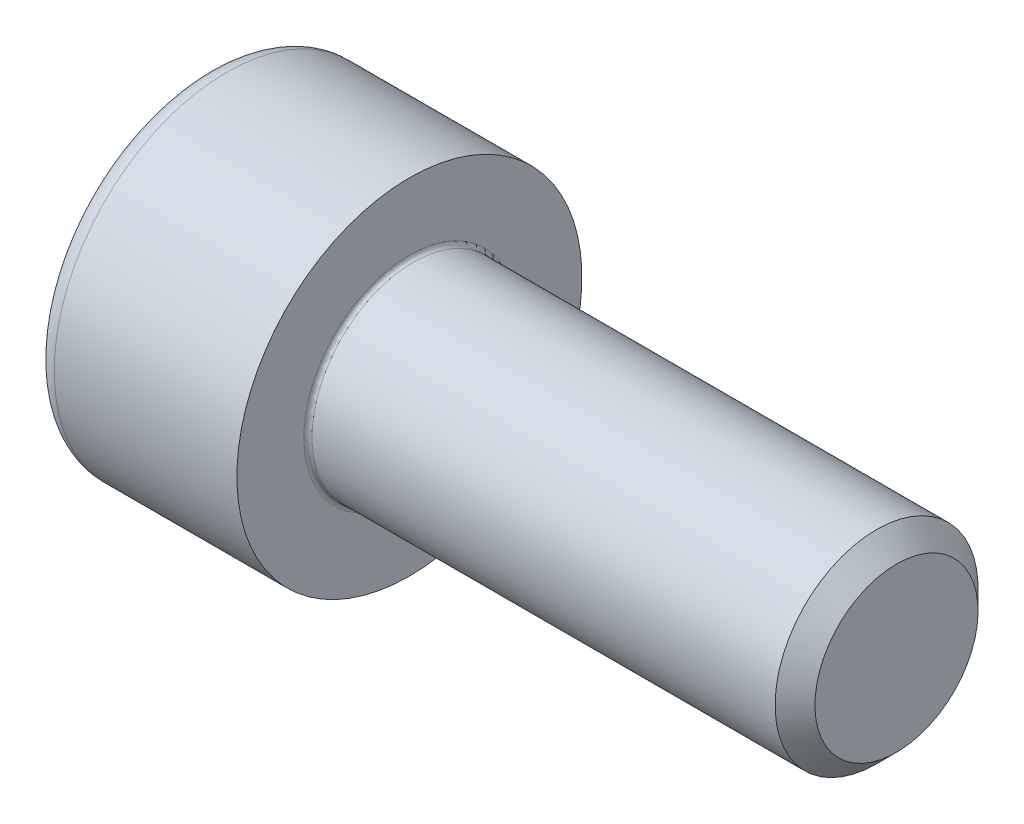
ISO-10303-21;
HEADER;
FILE_DESCRIPTION(('STEP AP214'),'2;1');
FILE_NAME('part.step','',(''),(''),'','','');
FILE_SCHEMA(('AUTOMOTIVE_DESIGN { 1 0 10303 214 1 1 1 1 }'));
ENDSEC;
DATA;
#1=APPLICATION_CONTEXT('core data for automotive mechanical design processes');
#2=APPLICATION_PROTOCOL_DEFINITION('international standard','automotive_design',2000,#1);
#3=PRODUCT_CONTEXT('',#1,'mechanical');
#4=PRODUCT('Part','Part','',(#3));
#5=PRODUCT_RELATED_PRODUCT_CATEGORY('part','',(#4));
#6=PRODUCT_DEFINITION_FORMATION('','',#4);
#7=PRODUCT_DEFINITION_CONTEXT('part definition',#1,'design');
#8=PRODUCT_DEFINITION('design','',#6,#7);
#9=PRODUCT_DEFINITION_SHAPE('','',#8);
#10=(LENGTH_UNIT() NAMED_UNIT(*) SI_UNIT(.MILLI.,.METRE.));
#11=(NAMED_UNIT(*) PLANE_ANGLE_UNIT() SI_UNIT($,.RADIAN.));
#12=(NAMED_UNIT(*) SI_UNIT($,.STERADIAN.) SOLID_ANGLE_UNIT());
#13=UNCERTAINTY_MEASURE_WITH_UNIT(LENGTH_MEASURE(1.E-05),#10,'distance_accuracy_value','');
#14=(GEOMETRIC_REPRESENTATION_CONTEXT(3) GLOBAL_UNCERTAINTY_ASSIGNED_CONTEXT((#13)) GLOBAL_UNIT_ASSIGNED_CONTEXT((#10,
#11,#12)) REPRESENTATION_CONTEXT('',''));
#15=CARTESIAN_POINT('',(0.,0.,0.));
#16=DIRECTION('',(0.,0.,1.));
#17=DIRECTION('',(1.,0.,0.));
#18=AXIS2_PLACEMENT_3D('',#15,#16,#17);
#19=CARTESIAN_POINT('',(-1.83333333333333,0.,0.));
#20=DIRECTION('',(-1.,0.,0.));
#21=DIRECTION('',(0.,1.,0.));
#22=AXIS2_PLACEMENT_3D('',#19,#20,#21);
#23=CONICAL_SURFACE('',#22,1.15470053837925,1.0471975512);
#24=CARTESIAN_POINT('',(-1.1666666666719,0.,0.));
#25=VERTEX_POINT('',#24);
#26=VERTEX_LOOP('',#25);
#27=FACE_BOUND('',#26,.T.);
#28=CARTESIAN_POINT('',(-2.5,0.,2.3094010767585));
#29=CARTESIAN_POINT('',(-2.16666666666666,1.,1.73205080756886));
#30=CARTESIAN_POINT('',(-2.5,2.,1.15470053837925));
#31=(BOUNDED_CURVE() B_SPLINE_CURVE(2,(#28,#29,#30),.UNSPECIFIED.,.F.,
.F.) B_SPLINE_CURVE_WITH_KNOTS((3,3),(0.,0.233687227615583),
.UNSPECIFIED.) CURVE() GEOMETRIC_REPRESENTATION_ITEM() RATIONAL_B_SPLINE_CURVE((1.,
1.15470053837926,1.)) REPRESENTATION_ITEM(''));
#32=CARTESIAN_POINT('',(-2.5,0.,2.3094010767585));
#33=VERTEX_POINT('',#32);
#34=CARTESIAN_POINT('',(-2.5,2.,1.15470053837925));
#35=VERTEX_POINT('',#34);
#36=EDGE_CURVE('E136',#33,#35,#31,.T.);
#37=ORIENTED_EDGE('',*,*,#36,.T.);
#38=CARTESIAN_POINT('',(-2.5,2.,1.15470053837924));
#39=CARTESIAN_POINT('',(-2.16666666666666,2.,0.));
#40=CARTESIAN_POINT('',(-2.5,2.,-1.15470053837925));
#41=(BOUNDED_CURVE() B_SPLINE_CURVE(2,(#38,#39,#40),.UNSPECIFIED.,.F.,
.F.) B_SPLINE_CURVE_WITH_KNOTS((3,3),(0.,0.233687227615583),
.UNSPECIFIED.) CURVE() GEOMETRIC_REPRESENTATION_ITEM() RATIONAL_B_SPLINE_CURVE((1.,
1.15470053837925,1.)) REPRESENTATION_ITEM(''));
#42=CARTESIAN_POINT('',(-2.5,2.,-1.15470053837925));
#43=VERTEX_POINT('',#42);
#44=EDGE_CURVE('E155',#35,#43,#41,.T.);
#45=ORIENTED_EDGE('',*,*,#44,.T.);
#46=CARTESIAN_POINT('',(-2.5,2.,-1.15470053837926));
#47=CARTESIAN_POINT('',(-2.16666666666666,1.,-1.73205080756888));
#48=CARTESIAN_POINT('',(-2.5,0.,-2.3094010767585));
#49=(BOUNDED_CURVE() B_SPLINE_CURVE(2,(#46,#47,#48),.UNSPECIFIED.,.F.,
.F.) B_SPLINE_CURVE_WITH_KNOTS((3,3),(0.,0.233687227615583),
.UNSPECIFIED.) CURVE() GEOMETRIC_REPRESENTATION_ITEM() RATIONAL_B_SPLINE_CURVE((1.,
1.15470053837925,1.)) REPRESENTATION_ITEM(''));
#50=CARTESIAN_POINT('',(-2.5,0.,-2.3094010767585));
#51=VERTEX_POINT('',#50);
#52=EDGE_CURVE('E156',#43,#51,#49,.T.);
#53=ORIENTED_EDGE('',*,*,#52,.T.);
#54=CARTESIAN_POINT('',(-2.5,0.,-2.3094010767585));
#55=CARTESIAN_POINT('',(-2.16666666666666,-1.,-1.73205080756888));
#56=CARTESIAN_POINT('',(-2.5,-2.,-1.15470053837925));
#57=(BOUNDED_CURVE() B_SPLINE_CURVE(2,(#54,#55,#56),.UNSPECIFIED.,.F.,
.F.) B_SPLINE_CURVE_WITH_KNOTS((3,3),(0.,0.233687227615583),
.UNSPECIFIED.) CURVE() GEOMETRIC_REPRESENTATION_ITEM() RATIONAL_B_SPLINE_CURVE((1.,
1.15470053837925,1.)) REPRESENTATION_ITEM(''));
#58=CARTESIAN_POINT('',(-2.5,-2.,-1.15470053837925));
#59=VERTEX_POINT('',#58);
#60=EDGE_CURVE('E191',#51,#59,#57,.T.);
#61=ORIENTED_EDGE('',*,*,#60,.T.);
#62=CARTESIAN_POINT('',(-2.5,-2.,-1.15470053837925));
#63=CARTESIAN_POINT('',(-2.16666666666666,-2.,0.));
#64=CARTESIAN_POINT('',(-2.5,-2.,1.15470053837925));
#65=(BOUNDED_CURVE() B_SPLINE_CURVE(2,(#62,#63,#64),.UNSPECIFIED.,.F.,
.F.) B_SPLINE_CURVE_WITH_KNOTS((3,3),(0.,0.233687227615583),
.UNSPECIFIED.) CURVE() GEOMETRIC_REPRESENTATION_ITEM() RATIONAL_B_SPLINE_CURVE((1.,
1.15470053837925,1.)) REPRESENTATION_ITEM(''));
#66=CARTESIAN_POINT('',(-2.5,-2.,1.15470053837925));
#67=VERTEX_POINT('',#66);
#68=EDGE_CURVE('E151',#59,#67,#65,.T.);
#69=ORIENTED_EDGE('',*,*,#68,.T.);
#70=CARTESIAN_POINT('',(-2.5,-2.,1.15470053837925));
#71=CARTESIAN_POINT('',(-2.16666666666666,-1.,1.73205080756888));
#72=CARTESIAN_POINT('',(-2.5,0.,2.3094010767585));
#73=(BOUNDED_CURVE() B_SPLINE_CURVE(2,(#70,#71,#72),.UNSPECIFIED.,.F.,
.F.) B_SPLINE_CURVE_WITH_KNOTS((3,3),(0.,0.233687227615583),
.UNSPECIFIED.) CURVE() GEOMETRIC_REPRESENTATION_ITEM() RATIONAL_B_SPLINE_CURVE((1.,
1.15470053837925,1.)) REPRESENTATION_ITEM(''));
#74=EDGE_CURVE('E11',#67,#33,#73,.T.);
#75=ORIENTED_EDGE('',*,*,#74,.T.);
#76=EDGE_LOOP('',(#37,#45,#53,#61,#69,#75));
#77=FACE_BOUND('',#76,.T.);
#78=ADVANCED_FACE('F16',(#27,#77),#23,.F.);
#79=CARTESIAN_POINT('',(-5.,-2.,1.15470053837925));
#80=DIRECTION('',(0.,-0.5,0.866025403784439));
#81=DIRECTION('',(-1.,0.,0.));
#82=AXIS2_PLACEMENT_3D('',#79,#80,#81);
#83=PLANE('',#82);
#84=ORIENTED_EDGE('',*,*,#74,.F.);
#85=DIRECTION('',(-1.,0.,0.));
#86=VECTOR('',#85,1.);
#87=CARTESIAN_POINT('',(-3.75,-2.,1.15470053837925));
#88=LINE('',#87,#86);
#89=CARTESIAN_POINT('',(-5.,-2.,1.15470053837925));
#90=VERTEX_POINT('',#89);
#91=EDGE_CURVE('E26',#67,#90,#88,.T.);
#92=ORIENTED_EDGE('',*,*,#91,.T.);
#93=DIRECTION('',(0.,-0.866025403784439,-0.5));
#94=VECTOR('',#93,1.);
#95=CARTESIAN_POINT('',(-5.,-1.5,1.44337567297407));
#96=LINE('',#95,#94);
#97=CARTESIAN_POINT('',(-5.,0.,2.3094010767585));
#98=VERTEX_POINT('',#97);
#99=EDGE_CURVE('E169',#98,#90,#96,.T.);
#100=ORIENTED_EDGE('',*,*,#99,.F.);
#101=DIRECTION('',(1.,0.,0.));
#102=VECTOR('',#101,1.);
#103=CARTESIAN_POINT('',(-3.75,0.,2.3094010767585));
#104=LINE('',#103,#102);
#105=EDGE_CURVE('E114',#98,#33,#104,.T.);
#106=ORIENTED_EDGE('',*,*,#105,.T.);
#107=EDGE_LOOP('',(#84,#92,#100,#106));
#108=FACE_BOUND('',#107,.T.);
#109=ADVANCED_FACE('F263',(#108),#83,.F.);
#110=CARTESIAN_POINT('',(-5.,-2.,-1.15470053837925));
#111=DIRECTION('',(0.,-1.,0.));
#112=DIRECTION('',(-1.,0.,0.));
#113=AXIS2_PLACEMENT_3D('',#110,#111,#112);
#114=PLANE('',#113);
#115=ORIENTED_EDGE('',*,*,#68,.F.);
#116=DIRECTION('',(-1.,0.,0.));
#117=VECTOR('',#116,1.);
#118=CARTESIAN_POINT('',(-3.75,-2.,-1.15470053837925));
#119=LINE('',#118,#117);
#120=CARTESIAN_POINT('',(-5.,-2.,-1.15470053837925));
#121=VERTEX_POINT('',#120);
#122=EDGE_CURVE('E184',#59,#121,#119,.T.);
#123=ORIENTED_EDGE('',*,*,#122,.T.);
#124=DIRECTION('',(0.,0.,-1.));
#125=VECTOR('',#124,1.);
#126=CARTESIAN_POINT('',(-5.,-2.,-0.577350269189625));
#127=LINE('',#126,#125);
#128=EDGE_CURVE('E174',#90,#121,#127,.T.);
#129=ORIENTED_EDGE('',*,*,#128,.F.);
#130=ORIENTED_EDGE('',*,*,#91,.F.);
#131=EDGE_LOOP('',(#115,#123,#129,#130));
#132=FACE_BOUND('',#131,.T.);
#133=ADVANCED_FACE('F268',(#132),#114,.F.);
#134=CARTESIAN_POINT('',(-5.,0.,2.3094010767585));
#135=DIRECTION('',(0.,0.5,0.866025403784439));
#136=DIRECTION('',(1.,0.,0.));
#137=AXIS2_PLACEMENT_3D('',#134,#135,#136);
#138=PLANE('',#137);
#139=ORIENTED_EDGE('',*,*,#36,.F.);
#140=ORIENTED_EDGE('',*,*,#105,.F.);
#141=DIRECTION('',(0.,-0.866025403784439,0.5));
#142=VECTOR('',#141,1.);
#143=CARTESIAN_POINT('',(-5.,0.5,2.02072594216369));
#144=LINE('',#143,#142);
#145=CARTESIAN_POINT('',(-5.,2.,1.15470053837925));
#146=VERTEX_POINT('',#145);
#147=EDGE_CURVE('E162',#146,#98,#144,.T.);
#148=ORIENTED_EDGE('',*,*,#147,.F.);
#149=DIRECTION('',(-1.,0.,0.));
#150=VECTOR('',#149,1.);
#151=CARTESIAN_POINT('',(-3.75,2.,1.15470053837925));
#152=LINE('',#151,#150);
#153=EDGE_CURVE('E141',#35,#146,#152,.T.);
#154=ORIENTED_EDGE('',*,*,#153,.F.);
#155=EDGE_LOOP('',(#139,#140,#148,#154));
#156=FACE_BOUND('',#155,.T.);
#157=ADVANCED_FACE('F293',(#156),#138,.F.);
#158=CARTESIAN_POINT('',(-5.,2.,1.15470053837925));
#159=DIRECTION('',(0.,1.,0.));
#160=DIRECTION('',(0.,0.,-1.));
#161=AXIS2_PLACEMENT_3D('',#158,#159,#160);
#162=PLANE('',#161);
#163=ORIENTED_EDGE('',*,*,#44,.F.);
#164=ORIENTED_EDGE('',*,*,#153,.T.);
#165=DIRECTION('',(0.,0.,1.));
#166=VECTOR('',#165,1.);
#167=CARTESIAN_POINT('',(-5.,2.,0.577350269189624));
#168=LINE('',#167,#166);
#169=CARTESIAN_POINT('',(-5.,2.,-1.15470053837925));
#170=VERTEX_POINT('',#169);
#171=EDGE_CURVE('E170',#170,#146,#168,.T.);
#172=ORIENTED_EDGE('',*,*,#171,.F.);
#173=DIRECTION('',(-1.,0.,0.));
#174=VECTOR('',#173,1.);
#175=CARTESIAN_POINT('',(-3.75,2.,-1.15470053837925));
#176=LINE('',#175,#174);
#177=EDGE_CURVE('E152',#43,#170,#176,.T.);
#178=ORIENTED_EDGE('',*,*,#177,.F.);
#179=EDGE_LOOP('',(#163,#164,#172,#178));
#180=FACE_BOUND('',#179,.T.);
#181=ADVANCED_FACE('F289',(#180),#162,.F.);
#182=CARTESIAN_POINT('',(-5.,2.,-1.15470053837925));
#183=DIRECTION('',(0.,0.5,-0.866025403784439));
#184=DIRECTION('',(-1.,0.,0.));
#185=AXIS2_PLACEMENT_3D('',#182,#183,#184);
#186=PLANE('',#185);
#187=ORIENTED_EDGE('',*,*,#52,.F.);
#188=ORIENTED_EDGE('',*,*,#177,.T.);
#189=DIRECTION('',(0.,0.866025403784439,0.5));
#190=VECTOR('',#189,1.);
#191=CARTESIAN_POINT('',(-5.,1.5,-1.44337567297407));
#192=LINE('',#191,#190);
#193=CARTESIAN_POINT('',(-5.,0.,-2.3094010767585));
#194=VERTEX_POINT('',#193);
#195=EDGE_CURVE('E181',#194,#170,#192,.T.);
#196=ORIENTED_EDGE('',*,*,#195,.F.);
#197=DIRECTION('',(-1.,0.,0.));
#198=VECTOR('',#197,1.);
#199=CARTESIAN_POINT('',(-3.75,0.,-2.3094010767585));
#200=LINE('',#199,#198);
#201=EDGE_CURVE('E187',#51,#194,#200,.T.);
#202=ORIENTED_EDGE('',*,*,#201,.F.);
#203=EDGE_LOOP('',(#187,#188,#196,#202));
#204=FACE_BOUND('',#203,.T.);
#205=ADVANCED_FACE('F292',(#204),#186,.F.);
#206=CARTESIAN_POINT('',(-5.,0.,-2.3094010767585));
#207=DIRECTION('',(0.,-0.5,-0.866025403784439));
#208=DIRECTION('',(0.,-0.866025403784439,0.5));
#209=AXIS2_PLACEMENT_3D('',#206,#207,#208);
#210=PLANE('',#209);
#211=ORIENTED_EDGE('',*,*,#60,.F.);
#212=ORIENTED_EDGE('',*,*,#201,.T.);
#213=DIRECTION('',(0.,0.866025403784439,-0.5));
#214=VECTOR('',#213,1.);
#215=CARTESIAN_POINT('',(-5.,-0.5,-2.02072594216369));
#216=LINE('',#215,#214);
#217=EDGE_CURVE('E177',#121,#194,#216,.T.);
#218=ORIENTED_EDGE('',*,*,#217,.F.);
#219=ORIENTED_EDGE('',*,*,#122,.F.);
#220=EDGE_LOOP('',(#211,#212,#218,#219));
#221=FACE_BOUND('',#220,.T.);
#222=ADVANCED_FACE('F243',(#221),#210,.F.);
#223=CARTESIAN_POINT('',(-2.5,0.,0.));
#224=DIRECTION('',(1.,0.,0.));
#225=DIRECTION('',(0.,1.,0.));
#226=AXIS2_PLACEMENT_3D('',#223,#224,#225);
#227=CYLINDRICAL_SURFACE('',#226,4.25);
#228=CARTESIAN_POINT('',(-4.5,0.,0.));
#229=DIRECTION('',(-1.,0.,0.));
#230=DIRECTION('',(0.,-1.,0.));
#231=AXIS2_PLACEMENT_3D('',#228,#229,#230);
#232=CIRCLE('',#231,4.25);
#233=CARTESIAN_POINT('',(-4.5,4.25,0.));
#234=VERTEX_POINT('',#233);
#235=EDGE_CURVE('E148',#234,#234,#232,.T.);
#236=ORIENTED_EDGE('',*,*,#235,.F.);
#237=EDGE_LOOP('',(#236));
#238=FACE_BOUND('',#237,.T.);
#239=CARTESIAN_POINT('',(0.,0.,0.));
#240=DIRECTION('',(1.,0.,0.));
#241=DIRECTION('',(0.,1.,0.));
#242=AXIS2_PLACEMENT_3D('',#239,#240,#241);
#243=CIRCLE('',#242,4.25);
#244=CARTESIAN_POINT('',(0.,4.25,0.));
#245=VERTEX_POINT('',#244);
#246=EDGE_CURVE('E125',#245,#245,#243,.T.);
#247=ORIENTED_EDGE('',*,*,#246,.F.);
#248=EDGE_LOOP('',(#247));
#249=FACE_BOUND('',#248,.T.);
#250=ADVANCED_FACE('F239',(#238,#249),#227,.T.);
#251=CARTESIAN_POINT('',(-5.,3.27970053837925,0.));
#252=DIRECTION('',(-1.,0.,0.));
#253=DIRECTION('',(0.,1.,0.));
#254=AXIS2_PLACEMENT_3D('',#251,#252,#253);
#255=PLANE('',#254);
#256=CARTESIAN_POINT('',(-5.,0.,0.));
#257=DIRECTION('',(1.,0.,0.));
#258=DIRECTION('',(0.,-1.,0.));
#259=AXIS2_PLACEMENT_3D('',#256,#257,#258);
#260=CIRCLE('',#259,3.75);
#261=CARTESIAN_POINT('',(-5.,3.75,0.));
#262=VERTEX_POINT('',#261);
#263=EDGE_CURVE('E142',#262,#262,#260,.T.);
#264=ORIENTED_EDGE('',*,*,#263,.F.);
#265=EDGE_LOOP('',(#264));
#266=FACE_BOUND('',#265,.T.);
#267=ORIENTED_EDGE('',*,*,#171,.T.);
#268=ORIENTED_EDGE('',*,*,#147,.T.);
#269=ORIENTED_EDGE('',*,*,#99,.T.);
#270=ORIENTED_EDGE('',*,*,#128,.T.);
#271=ORIENTED_EDGE('',*,*,#217,.T.);
#272=ORIENTED_EDGE('',*,*,#195,.T.);
#273=EDGE_LOOP('',(#267,#268,#269,#270,#271,#272));
#274=FACE_BOUND('',#273,.T.);
#275=ADVANCED_FACE('F242',(#266,#274),#255,.T.);
#276=CARTESIAN_POINT('',(-4.5,0.,0.));
#277=DIRECTION('',(1.,0.,0.));
#278=DIRECTION('',(0.,0.,-1.));
#279=AXIS2_PLACEMENT_3D('',#276,#277,#278);
#280=TOROIDAL_SURFACE('',#279,3.75,0.5);
#281=ORIENTED_EDGE('',*,*,#235,.T.);
#282=EDGE_LOOP('',(#281));
#283=FACE_BOUND('',#282,.T.);
#284=ORIENTED_EDGE('',*,*,#263,.T.);
#285=EDGE_LOOP('',(#284));
#286=FACE_BOUND('',#285,.T.);
#287=ADVANCED_FACE('F236',(#283,#286),#280,.T.);
#288=CARTESIAN_POINT('',(12.,1.25,0.));
#289=DIRECTION('',(1.,0.,0.));
#290=DIRECTION('',(0.,1.,0.));
#291=AXIS2_PLACEMENT_3D('',#288,#289,#290);
#292=PLANE('',#291);
#293=CARTESIAN_POINT('',(12.,0.,0.));
#294=DIRECTION('',(-1.,0.,0.));
#295=DIRECTION('',(0.,-1.,0.));
#296=AXIS2_PLACEMENT_3D('',#293,#294,#295);
#297=CIRCLE('',#296,2.00924);
#298=CARTESIAN_POINT('',(12.,2.00924,0.));
#299=VERTEX_POINT('',#298);
#300=EDGE_CURVE('E132',#299,#299,#297,.T.);
#301=ORIENTED_EDGE('',*,*,#300,.F.);
#302=EDGE_LOOP('',(#301));
#303=FACE_BOUND('',#302,.T.);
#304=ADVANCED_FACE('F258',(#303),#292,.T.);
#305=CARTESIAN_POINT('',(11.75462,0.,0.));
#306=DIRECTION('',(-1.,0.,0.));
#307=DIRECTION('',(0.,-1.,0.));
#308=AXIS2_PLACEMENT_3D('',#305,#306,#307);
#309=CONICAL_SURFACE('',#308,2.25462,0.785398163399998);
#310=ORIENTED_EDGE('',*,*,#300,.T.);
#311=EDGE_LOOP('',(#310));
#312=FACE_BOUND('',#311,.T.);
#313=CARTESIAN_POINT('',(11.50924,0.,0.));
#314=DIRECTION('',(1.,0.,0.));
#315=DIRECTION('',(0.,-1.,0.));
#316=AXIS2_PLACEMENT_3D('',#313,#314,#315);
#317=CIRCLE('',#316,2.5);
#318=CARTESIAN_POINT('',(11.50924,2.5,0.));
#319=VERTEX_POINT('',#318);
#320=EDGE_CURVE('E121',#319,#319,#317,.T.);
#321=ORIENTED_EDGE('',*,*,#320,.T.);
#322=EDGE_LOOP('',(#321));
#323=FACE_BOUND('',#322,.T.);
#324=ADVANCED_FACE('F122',(#312,#323),#309,.T.);
#325=CARTESIAN_POINT('',(0.,3.375,0.));
#326=DIRECTION('',(1.,0.,0.));
#327=DIRECTION('',(0.,1.,0.));
#328=AXIS2_PLACEMENT_3D('',#325,#326,#327);
#329=PLANE('',#328);
#330=CARTESIAN_POINT('',(0.,0.,0.));
#331=DIRECTION('',(1.,0.,0.));
#332=DIRECTION('',(0.,-1.,0.));
#333=AXIS2_PLACEMENT_3D('',#330,#331,#332);
#334=CIRCLE('',#333,2.6);
#335=CARTESIAN_POINT('',(0.,2.6,0.));
#336=VERTEX_POINT('',#335);
#337=EDGE_CURVE('E134',#336,#336,#334,.T.);
#338=ORIENTED_EDGE('',*,*,#337,.F.);
#339=EDGE_LOOP('',(#338));
#340=FACE_BOUND('',#339,.T.);
#341=ORIENTED_EDGE('',*,*,#246,.T.);
#342=EDGE_LOOP('',(#341));
#343=FACE_BOUND('',#342,.T.);
#344=ADVANCED_FACE('F18',(#340,#343),#329,.T.);
#345=CARTESIAN_POINT('',(7.,0.,0.));
#346=DIRECTION('',(1.,0.,0.));
#347=DIRECTION('',(0.,1.,0.));
#348=AXIS2_PLACEMENT_3D('',#345,#346,#347);
#349=CYLINDRICAL_SURFACE('',#348,2.5);
#350=CARTESIAN_POINT('',(0.100000000000002,0.,0.));
#351=DIRECTION('',(-1.,0.,0.));
#352=DIRECTION('',(0.,-1.,0.));
#353=AXIS2_PLACEMENT_3D('',#350,#351,#352);
#354=CIRCLE('',#353,2.5);
#355=CARTESIAN_POINT('',(0.100000000000002,2.5,0.));
#356=VERTEX_POINT('',#355);
#357=EDGE_CURVE('E20',#356,#356,#354,.T.);
#358=ORIENTED_EDGE('',*,*,#357,.F.);
#359=EDGE_LOOP('',(#358));
#360=FACE_BOUND('',#359,.T.);
#361=ORIENTED_EDGE('',*,*,#320,.F.);
#362=EDGE_LOOP('',(#361));
#363=FACE_BOUND('',#362,.T.);
#364=ADVANCED_FACE('F248',(#360,#363),#349,.T.);
#365=CARTESIAN_POINT('',(0.100000000000002,0.,0.));
#366=DIRECTION('',(1.,0.,0.));
#367=DIRECTION('',(0.,0.,-1.));
#368=AXIS2_PLACEMENT_3D('',#365,#366,#367);
#369=TOROIDAL_SURFACE('',#368,2.6,0.1);
#370=ORIENTED_EDGE('',*,*,#357,.T.);
#371=EDGE_LOOP('',(#370));
#372=FACE_BOUND('',#371,.T.);
#373=ORIENTED_EDGE('',*,*,#337,.T.);
#374=EDGE_LOOP('',(#373));
#375=FACE_BOUND('',#374,.T.);
#376=ADVANCED_FACE('F255',(#372,#375),#369,.F.);
#377=CLOSED_SHELL('',(#78,#109,#133,#157,#181,#205,#222,#250,#275,#287,#304,#324,#344,#364,#376));
#378=MANIFOLD_SOLID_BREP('B1',#377);
#379=ADVANCED_BREP_SHAPE_REPRESENTATION('',(#18,#378),#14);
#380=SHAPE_DEFINITION_REPRESENTATION(#9,#379);
ENDSEC;
END-ISO-10303-21;
